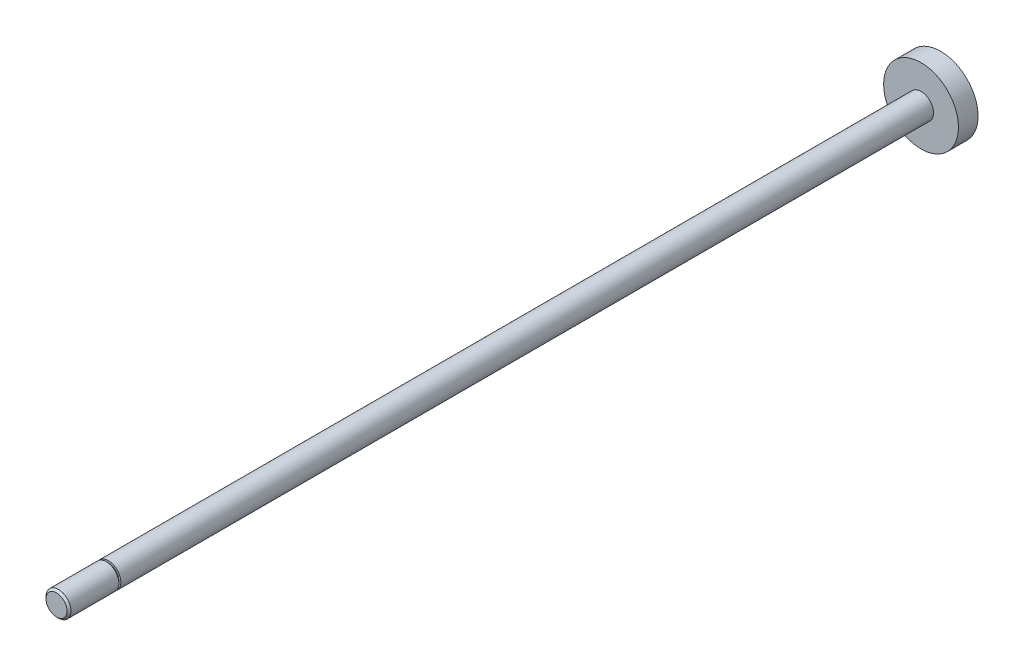
ISO-10303-21;
HEADER;
FILE_DESCRIPTION(('STEP AP214'),'2;1');
FILE_NAME('part.step','',(''),(''),'','','');
FILE_SCHEMA(('AUTOMOTIVE_DESIGN { 1 0 10303 214 1 1 1 1 }'));
ENDSEC;
DATA;
#1=APPLICATION_CONTEXT('core data for automotive mechanical design processes');
#2=APPLICATION_PROTOCOL_DEFINITION('international standard','automotive_design',2000,#1);
#3=PRODUCT_CONTEXT('',#1,'mechanical');
#4=PRODUCT('Part','Part','',(#3));
#5=PRODUCT_RELATED_PRODUCT_CATEGORY('part','',(#4));
#6=PRODUCT_DEFINITION_FORMATION('','',#4);
#7=PRODUCT_DEFINITION_CONTEXT('part definition',#1,'design');
#8=PRODUCT_DEFINITION('design','',#6,#7);
#9=PRODUCT_DEFINITION_SHAPE('','',#8);
#10=(LENGTH_UNIT() NAMED_UNIT(*) SI_UNIT(.MILLI.,.METRE.));
#11=(NAMED_UNIT(*) PLANE_ANGLE_UNIT() SI_UNIT($,.RADIAN.));
#12=(NAMED_UNIT(*) SI_UNIT($,.STERADIAN.) SOLID_ANGLE_UNIT());
#13=UNCERTAINTY_MEASURE_WITH_UNIT(LENGTH_MEASURE(1.E-05),#10,'distance_accuracy_value','');
#14=(GEOMETRIC_REPRESENTATION_CONTEXT(3) GLOBAL_UNCERTAINTY_ASSIGNED_CONTEXT((#13)) GLOBAL_UNIT_ASSIGNED_CONTEXT((#10,
#11,#12)) REPRESENTATION_CONTEXT('',''));
#15=CARTESIAN_POINT('',(0.,0.,0.));
#16=DIRECTION('',(0.,0.,1.));
#17=DIRECTION('',(1.,0.,0.));
#18=AXIS2_PLACEMENT_3D('',#15,#16,#17);
#19=CARTESIAN_POINT('',(0.,0.,145.931));
#20=DIRECTION('',(0.,0.,-1.));
#21=DIRECTION('',(-1.,0.,0.));
#22=AXIS2_PLACEMENT_3D('',#19,#20,#21);
#23=CONICAL_SURFACE('',#22,3.17499999999995,0.785398163397453);
#24=CARTESIAN_POINT('',(0.,0.,146.431));
#25=DIRECTION('',(0.,0.,-1.));
#26=DIRECTION('',(-1.,0.,0.));
#27=AXIS2_PLACEMENT_3D('',#24,#25,#26);
#28=CIRCLE('',#27,2.67499999999994);
#29=CARTESIAN_POINT('',(-2.67499999999994,0.,146.431));
#30=VERTEX_POINT('',#29);
#31=EDGE_CURVE('E10',#30,#30,#28,.T.);
#32=ORIENTED_EDGE('',*,*,#31,.T.);
#33=EDGE_LOOP('',(#32));
#34=FACE_BOUND('',#33,.T.);
#35=CARTESIAN_POINT('',(0.,0.,145.931));
#36=DIRECTION('',(0.,0.,-1.));
#37=DIRECTION('',(-1.,0.,0.));
#38=AXIS2_PLACEMENT_3D('',#35,#36,#37);
#39=CIRCLE('',#38,3.17499999999995);
#40=CARTESIAN_POINT('',(-3.17499999999995,0.,145.931));
#41=VERTEX_POINT('',#40);
#42=EDGE_CURVE('E66',#41,#41,#39,.T.);
#43=ORIENTED_EDGE('',*,*,#42,.F.);
#44=EDGE_LOOP('',(#43));
#45=FACE_BOUND('',#44,.T.);
#46=ADVANCED_FACE('F35',(#34,#45),#23,.T.);
#47=CARTESIAN_POINT('',(2.67499999999994,0.,146.431));
#48=DIRECTION('',(0.,0.,1.));
#49=DIRECTION('',(1.,0.,0.));
#50=AXIS2_PLACEMENT_3D('',#47,#48,#49);
#51=PLANE('',#50);
#52=ORIENTED_EDGE('',*,*,#31,.F.);
#53=EDGE_LOOP('',(#52));
#54=FACE_BOUND('',#53,.T.);
#55=ADVANCED_FACE('F74',(#54),#51,.T.);
#56=CARTESIAN_POINT('',(0.,0.,-78.7));
#57=DIRECTION('',(0.,0.,-1.));
#58=DIRECTION('',(-1.,0.,0.));
#59=AXIS2_PLACEMENT_3D('',#56,#57,#58);
#60=PLANE('',#59);
#61=CARTESIAN_POINT('',(0.,0.,-78.7));
#62=DIRECTION('',(0.,0.,-1.));
#63=DIRECTION('',(-1.,0.,0.));
#64=AXIS2_PLACEMENT_3D('',#61,#62,#63);
#65=CIRCLE('',#64,9.525);
#66=CARTESIAN_POINT('',(-9.525,0.,-78.7));
#67=VERTEX_POINT('',#66);
#68=EDGE_CURVE('E41',#67,#67,#65,.T.);
#69=ORIENTED_EDGE('',*,*,#68,.T.);
#70=EDGE_LOOP('',(#69));
#71=FACE_BOUND('',#70,.T.);
#72=ADVANCED_FACE('F78',(#71),#60,.T.);
#73=CARTESIAN_POINT('',(0.,0.,146.431));
#74=DIRECTION('',(0.,0.,-1.));
#75=DIRECTION('',(-1.,0.,0.));
#76=AXIS2_PLACEMENT_3D('',#73,#74,#75);
#77=CYLINDRICAL_SURFACE('',#76,9.525);
#78=CARTESIAN_POINT('',(0.,0.,-73.7));
#79=DIRECTION('',(0.,0.,-1.));
#80=DIRECTION('',(-1.,0.,0.));
#81=AXIS2_PLACEMENT_3D('',#78,#79,#80);
#82=CIRCLE('',#81,9.525);
#83=CARTESIAN_POINT('',(-9.525,0.,-73.7));
#84=VERTEX_POINT('',#83);
#85=EDGE_CURVE('E45',#84,#84,#82,.T.);
#86=ORIENTED_EDGE('',*,*,#85,.T.);
#87=EDGE_LOOP('',(#86));
#88=FACE_BOUND('',#87,.T.);
#89=ORIENTED_EDGE('',*,*,#68,.F.);
#90=EDGE_LOOP('',(#89));
#91=FACE_BOUND('',#90,.T.);
#92=ADVANCED_FACE('F83',(#88,#91),#77,.T.);
#93=CARTESIAN_POINT('',(9.525,0.,-73.7));
#94=DIRECTION('',(0.,0.,1.));
#95=DIRECTION('',(1.,0.,0.));
#96=AXIS2_PLACEMENT_3D('',#93,#94,#95);
#97=PLANE('',#96);
#98=CARTESIAN_POINT('',(0.,0.,-73.7));
#99=DIRECTION('',(0.,0.,-1.));
#100=DIRECTION('',(-1.,0.,0.));
#101=AXIS2_PLACEMENT_3D('',#98,#99,#100);
#102=CIRCLE('',#101,3.175);
#103=CARTESIAN_POINT('',(-3.175,0.,-73.7));
#104=VERTEX_POINT('',#103);
#105=EDGE_CURVE('E49',#104,#104,#102,.T.);
#106=ORIENTED_EDGE('',*,*,#105,.T.);
#107=EDGE_LOOP('',(#106));
#108=FACE_BOUND('',#107,.T.);
#109=ORIENTED_EDGE('',*,*,#85,.F.);
#110=EDGE_LOOP('',(#109));
#111=FACE_BOUND('',#110,.T.);
#112=ADVANCED_FACE('F88',(#108,#111),#97,.T.);
#113=CARTESIAN_POINT('',(0.,0.,146.431));
#114=DIRECTION('',(0.,0.,-1.));
#115=DIRECTION('',(-1.,0.,0.));
#116=AXIS2_PLACEMENT_3D('',#113,#114,#115);
#117=CYLINDRICAL_SURFACE('',#116,3.175);
#118=CARTESIAN_POINT('',(0.,0.,133.231));
#119=DIRECTION('',(0.,0.,-1.));
#120=DIRECTION('',(-1.,0.,0.));
#121=AXIS2_PLACEMENT_3D('',#118,#119,#120);
#122=CIRCLE('',#121,3.175);
#123=CARTESIAN_POINT('',(-3.175,0.,133.231));
#124=VERTEX_POINT('',#123);
#125=EDGE_CURVE('E54',#124,#124,#122,.T.);
#126=ORIENTED_EDGE('',*,*,#125,.T.);
#127=EDGE_LOOP('',(#126));
#128=FACE_BOUND('',#127,.T.);
#129=ORIENTED_EDGE('',*,*,#105,.F.);
#130=EDGE_LOOP('',(#129));
#131=FACE_BOUND('',#130,.T.);
#132=ADVANCED_FACE('F92',(#128,#131),#117,.T.);
#133=CARTESIAN_POINT('',(3.175,0.,133.231));
#134=DIRECTION('',(0.,0.,1.));
#135=DIRECTION('',(1.,0.,0.));
#136=AXIS2_PLACEMENT_3D('',#133,#134,#135);
#137=PLANE('',#136);
#138=CARTESIAN_POINT('',(0.,0.,133.231));
#139=DIRECTION('',(0.,0.,-1.));
#140=DIRECTION('',(-1.,0.,0.));
#141=AXIS2_PLACEMENT_3D('',#138,#139,#140);
#142=CIRCLE('',#141,2.67499999999996);
#143=CARTESIAN_POINT('',(-2.67499999999996,0.,133.231));
#144=VERTEX_POINT('',#143);
#145=EDGE_CURVE('E57',#144,#144,#142,.T.);
#146=ORIENTED_EDGE('',*,*,#145,.T.);
#147=EDGE_LOOP('',(#146));
#148=FACE_BOUND('',#147,.T.);
#149=ORIENTED_EDGE('',*,*,#125,.F.);
#150=EDGE_LOOP('',(#149));
#151=FACE_BOUND('',#150,.T.);
#152=ADVANCED_FACE('F96',(#148,#151),#137,.T.);
#153=CARTESIAN_POINT('',(0.,0.,146.431));
#154=DIRECTION('',(0.,0.,-1.));
#155=DIRECTION('',(-1.,0.,0.));
#156=AXIS2_PLACEMENT_3D('',#153,#154,#155);
#157=CYLINDRICAL_SURFACE('',#156,2.67499999999996);
#158=CARTESIAN_POINT('',(0.,0.,133.731));
#159=DIRECTION('',(0.,0.,-1.));
#160=DIRECTION('',(-1.,0.,0.));
#161=AXIS2_PLACEMENT_3D('',#158,#159,#160);
#162=CIRCLE('',#161,2.67499999999996);
#163=CARTESIAN_POINT('',(-2.67499999999996,0.,133.731));
#164=VERTEX_POINT('',#163);
#165=EDGE_CURVE('E60',#164,#164,#162,.T.);
#166=ORIENTED_EDGE('',*,*,#165,.T.);
#167=EDGE_LOOP('',(#166));
#168=FACE_BOUND('',#167,.T.);
#169=ORIENTED_EDGE('',*,*,#145,.F.);
#170=EDGE_LOOP('',(#169));
#171=FACE_BOUND('',#170,.T.);
#172=ADVANCED_FACE('F100',(#168,#171),#157,.T.);
#173=CARTESIAN_POINT('',(2.67499999999996,0.,133.731));
#174=DIRECTION('',(0.,0.,-1.));
#175=DIRECTION('',(-1.,0.,0.));
#176=AXIS2_PLACEMENT_3D('',#173,#174,#175);
#177=PLANE('',#176);
#178=CARTESIAN_POINT('',(0.,0.,133.731));
#179=DIRECTION('',(0.,0.,-1.));
#180=DIRECTION('',(-1.,0.,0.));
#181=AXIS2_PLACEMENT_3D('',#178,#179,#180);
#182=CIRCLE('',#181,3.175);
#183=CARTESIAN_POINT('',(-3.175,0.,133.731));
#184=VERTEX_POINT('',#183);
#185=EDGE_CURVE('E63',#184,#184,#182,.T.);
#186=ORIENTED_EDGE('',*,*,#185,.T.);
#187=EDGE_LOOP('',(#186));
#188=FACE_BOUND('',#187,.T.);
#189=ORIENTED_EDGE('',*,*,#165,.F.);
#190=EDGE_LOOP('',(#189));
#191=FACE_BOUND('',#190,.T.);
#192=ADVANCED_FACE('F104',(#188,#191),#177,.T.);
#193=CARTESIAN_POINT('',(0.,0.,146.431));
#194=DIRECTION('',(0.,0.,-1.));
#195=DIRECTION('',(-1.,0.,0.));
#196=AXIS2_PLACEMENT_3D('',#193,#194,#195);
#197=CYLINDRICAL_SURFACE('',#196,3.17499999999997);
#198=ORIENTED_EDGE('',*,*,#42,.T.);
#199=EDGE_LOOP('',(#198));
#200=FACE_BOUND('',#199,.T.);
#201=ORIENTED_EDGE('',*,*,#185,.F.);
#202=EDGE_LOOP('',(#201));
#203=FACE_BOUND('',#202,.T.);
#204=ADVANCED_FACE('F70',(#200,#203),#197,.T.);
#205=CLOSED_SHELL('',(#46,#55,#72,#92,#112,#132,#152,#172,#192,#204));
#206=MANIFOLD_SOLID_BREP('B2',#205);
#207=ADVANCED_BREP_SHAPE_REPRESENTATION('',(#18,#206),#14);
#208=SHAPE_DEFINITION_REPRESENTATION(#9,#207);
ENDSEC;
END-ISO-10303-21;
